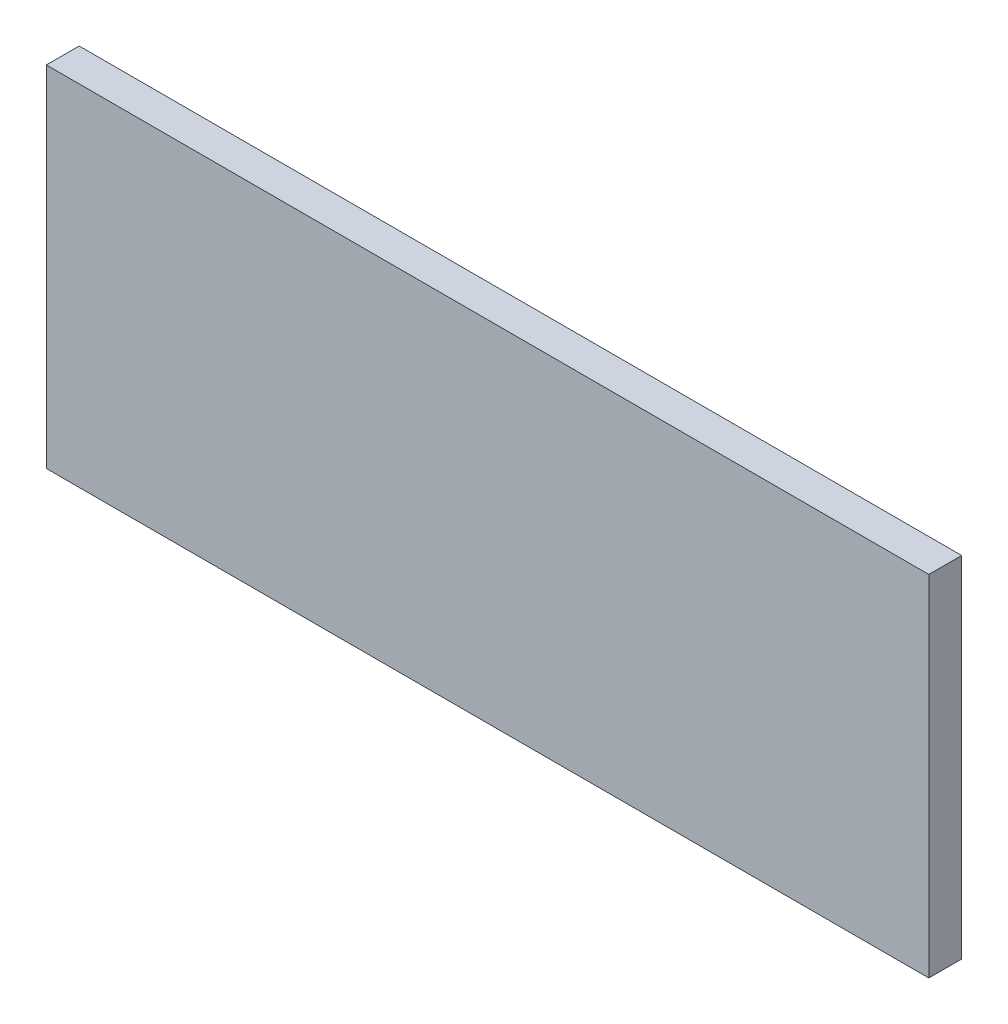
ISO-10303-21;
HEADER;
FILE_DESCRIPTION(('STEP AP214'),'2;1');
FILE_NAME('part.step','',(''),(''),'','','');
FILE_SCHEMA(('AUTOMOTIVE_DESIGN { 1 0 10303 214 1 1 1 1 }'));
ENDSEC;
DATA;
#1=APPLICATION_CONTEXT('core data for automotive mechanical design processes');
#2=APPLICATION_PROTOCOL_DEFINITION('international standard','automotive_design',2000,#1);
#3=PRODUCT_CONTEXT('',#1,'mechanical');
#4=PRODUCT('Part','Part','',(#3));
#5=PRODUCT_RELATED_PRODUCT_CATEGORY('part','',(#4));
#6=PRODUCT_DEFINITION_FORMATION('','',#4);
#7=PRODUCT_DEFINITION_CONTEXT('part definition',#1,'design');
#8=PRODUCT_DEFINITION('design','',#6,#7);
#9=PRODUCT_DEFINITION_SHAPE('','',#8);
#10=(LENGTH_UNIT() NAMED_UNIT(*) SI_UNIT(.MILLI.,.METRE.));
#11=(NAMED_UNIT(*) PLANE_ANGLE_UNIT() SI_UNIT($,.RADIAN.));
#12=(NAMED_UNIT(*) SI_UNIT($,.STERADIAN.) SOLID_ANGLE_UNIT());
#13=UNCERTAINTY_MEASURE_WITH_UNIT(LENGTH_MEASURE(1.E-05),#10,'distance_accuracy_value','');
#14=(GEOMETRIC_REPRESENTATION_CONTEXT(3) GLOBAL_UNCERTAINTY_ASSIGNED_CONTEXT((#13)) GLOBAL_UNIT_ASSIGNED_CONTEXT((#10,
#11,#12)) REPRESENTATION_CONTEXT('',''));
#15=CARTESIAN_POINT('',(0.,0.,0.));
#16=DIRECTION('',(0.,0.,1.));
#17=DIRECTION('',(1.,0.,0.));
#18=AXIS2_PLACEMENT_3D('',#15,#16,#17);
#19=CARTESIAN_POINT('',(38.9193321896784,48.3973428657123,15.9277503552776));
#20=DIRECTION('',(-1.,0.,0.));
#21=DIRECTION('',(0.,0.,1.));
#22=AXIS2_PLACEMENT_3D('',#19,#20,#21);
#23=PLANE('',#22);
#24=DIRECTION('',(0.,1.,0.));
#25=VECTOR('',#24,1.);
#26=CARTESIAN_POINT('',(38.9193321896784,48.3973428657123,14.9277503552776));
#27=LINE('',#26,#25);
#28=CARTESIAN_POINT('',(38.9193321896784,48.3973428657123,14.9277503552776));
#29=VERTEX_POINT('',#28);
#30=CARTESIAN_POINT('',(38.9193321896784,59.0392787902942,14.9277503552776));
#31=VERTEX_POINT('',#30);
#32=EDGE_CURVE('E97',#29,#31,#27,.T.);
#33=ORIENTED_EDGE('',*,*,#32,.T.);
#34=DIRECTION('',(0.,0.,-1.));
#35=VECTOR('',#34,1.);
#36=CARTESIAN_POINT('',(38.9193321896784,59.0392787902942,15.9277503552776));
#37=LINE('',#36,#35);
#38=CARTESIAN_POINT('',(38.9193321896784,59.0392787902942,15.9277503552776));
#39=VERTEX_POINT('',#38);
#40=EDGE_CURVE('E11',#39,#31,#37,.T.);
#41=ORIENTED_EDGE('',*,*,#40,.F.);
#42=DIRECTION('',(0.,1.,0.));
#43=VECTOR('',#42,1.);
#44=CARTESIAN_POINT('',(38.9193321896784,48.3973428657123,15.9277503552776));
#45=LINE('',#44,#43);
#46=CARTESIAN_POINT('',(38.9193321896784,48.3973428657123,15.9277503552776));
#47=VERTEX_POINT('',#46);
#48=EDGE_CURVE('E85',#47,#39,#45,.T.);
#49=ORIENTED_EDGE('',*,*,#48,.F.);
#50=DIRECTION('',(0.,0.,-1.));
#51=VECTOR('',#50,1.);
#52=CARTESIAN_POINT('',(38.9193321896784,48.3973428657123,15.9277503552776));
#53=LINE('',#52,#51);
#54=EDGE_CURVE('E93',#47,#29,#53,.T.);
#55=ORIENTED_EDGE('',*,*,#54,.T.);
#56=EDGE_LOOP('',(#33,#41,#49,#55));
#57=FACE_BOUND('',#56,.T.);
#58=ADVANCED_FACE('F34',(#57),#23,.F.);
#59=CARTESIAN_POINT('',(12.0487638720306,59.0392787902942,15.9277503552776));
#60=DIRECTION('',(0.,-1.,0.));
#61=DIRECTION('',(0.,0.,-1.));
#62=AXIS2_PLACEMENT_3D('',#59,#60,#61);
#63=PLANE('',#62);
#64=DIRECTION('',(-1.,0.,0.));
#65=VECTOR('',#64,1.);
#66=CARTESIAN_POINT('',(12.0487638720306,59.0392787902942,14.9277503552776));
#67=LINE('',#66,#65);
#68=CARTESIAN_POINT('',(12.0487638720306,59.0392787902942,14.9277503552776));
#69=VERTEX_POINT('',#68);
#70=EDGE_CURVE('E89',#31,#69,#67,.T.);
#71=ORIENTED_EDGE('',*,*,#70,.T.);
#72=DIRECTION('',(0.,0.,-1.));
#73=VECTOR('',#72,1.);
#74=CARTESIAN_POINT('',(12.0487638720306,59.0392787902942,15.9277503552776));
#75=LINE('',#74,#73);
#76=CARTESIAN_POINT('',(12.0487638720306,59.0392787902942,15.9277503552776));
#77=VERTEX_POINT('',#76);
#78=EDGE_CURVE('E42',#77,#69,#75,.T.);
#79=ORIENTED_EDGE('',*,*,#78,.F.);
#80=DIRECTION('',(-1.,0.,0.));
#81=VECTOR('',#80,1.);
#82=CARTESIAN_POINT('',(12.0487638720306,59.0392787902942,15.9277503552776));
#83=LINE('',#82,#81);
#84=EDGE_CURVE('E80',#39,#77,#83,.T.);
#85=ORIENTED_EDGE('',*,*,#84,.F.);
#86=ORIENTED_EDGE('',*,*,#40,.T.);
#87=EDGE_LOOP('',(#71,#79,#85,#86));
#88=FACE_BOUND('',#87,.T.);
#89=ADVANCED_FACE('F88',(#88),#63,.F.);
#90=CARTESIAN_POINT('',(12.0487638720306,48.3973428657123,15.9277503552776));
#91=DIRECTION('',(1.,0.,0.));
#92=DIRECTION('',(0.,0.,-1.));
#93=AXIS2_PLACEMENT_3D('',#90,#91,#92);
#94=PLANE('',#93);
#95=DIRECTION('',(0.,-1.,0.));
#96=VECTOR('',#95,1.);
#97=CARTESIAN_POINT('',(12.0487638720306,48.3973428657123,14.9277503552776));
#98=LINE('',#97,#96);
#99=CARTESIAN_POINT('',(12.0487638720306,48.3973428657123,14.9277503552776));
#100=VERTEX_POINT('',#99);
#101=EDGE_CURVE('E67',#69,#100,#98,.T.);
#102=ORIENTED_EDGE('',*,*,#101,.T.);
#103=DIRECTION('',(0.,0.,-1.));
#104=VECTOR('',#103,1.);
#105=CARTESIAN_POINT('',(12.0487638720306,48.3973428657123,15.9277503552776));
#106=LINE('',#105,#104);
#107=CARTESIAN_POINT('',(12.0487638720306,48.3973428657123,15.9277503552776));
#108=VERTEX_POINT('',#107);
#109=EDGE_CURVE('E90',#108,#100,#106,.T.);
#110=ORIENTED_EDGE('',*,*,#109,.F.);
#111=DIRECTION('',(0.,-1.,0.));
#112=VECTOR('',#111,1.);
#113=CARTESIAN_POINT('',(12.0487638720306,48.3973428657123,15.9277503552776));
#114=LINE('',#113,#112);
#115=EDGE_CURVE('E83',#77,#108,#114,.T.);
#116=ORIENTED_EDGE('',*,*,#115,.F.);
#117=ORIENTED_EDGE('',*,*,#78,.T.);
#118=EDGE_LOOP('',(#102,#110,#116,#117));
#119=FACE_BOUND('',#118,.T.);
#120=ADVANCED_FACE('F91',(#119),#94,.F.);
#121=CARTESIAN_POINT('',(12.0487638720306,48.3973428657123,15.9277503552776));
#122=DIRECTION('',(0.,1.,0.));
#123=DIRECTION('',(0.,0.,1.));
#124=AXIS2_PLACEMENT_3D('',#121,#122,#123);
#125=PLANE('',#124);
#126=DIRECTION('',(1.,0.,0.));
#127=VECTOR('',#126,1.);
#128=CARTESIAN_POINT('',(12.0487638720306,48.3973428657123,14.9277503552776));
#129=LINE('',#128,#127);
#130=EDGE_CURVE('E73',#100,#29,#129,.T.);
#131=ORIENTED_EDGE('',*,*,#130,.T.);
#132=ORIENTED_EDGE('',*,*,#54,.F.);
#133=DIRECTION('',(1.,0.,0.));
#134=VECTOR('',#133,1.);
#135=CARTESIAN_POINT('',(12.0487638720306,48.3973428657123,15.9277503552776));
#136=LINE('',#135,#134);
#137=EDGE_CURVE('E50',#108,#47,#136,.T.);
#138=ORIENTED_EDGE('',*,*,#137,.F.);
#139=ORIENTED_EDGE('',*,*,#109,.T.);
#140=EDGE_LOOP('',(#131,#132,#138,#139));
#141=FACE_BOUND('',#140,.T.);
#142=ADVANCED_FACE('F104',(#141),#125,.F.);
#143=CARTESIAN_POINT('',(0.,0.,15.9277503552776));
#144=DIRECTION('',(0.,0.,-1.));
#145=DIRECTION('',(-1.,0.,0.));
#146=AXIS2_PLACEMENT_3D('',#143,#144,#145);
#147=PLANE('',#146);
#148=ORIENTED_EDGE('',*,*,#48,.T.);
#149=ORIENTED_EDGE('',*,*,#84,.T.);
#150=ORIENTED_EDGE('',*,*,#115,.T.);
#151=ORIENTED_EDGE('',*,*,#137,.T.);
#152=EDGE_LOOP('',(#148,#149,#150,#151));
#153=FACE_BOUND('',#152,.T.);
#154=ADVANCED_FACE('F81',(#153),#147,.F.);
#155=CARTESIAN_POINT('',(0.,0.,14.9277503552776));
#156=DIRECTION('',(0.,0.,-1.));
#157=DIRECTION('',(-1.,0.,0.));
#158=AXIS2_PLACEMENT_3D('',#155,#156,#157);
#159=PLANE('',#158);
#160=ORIENTED_EDGE('',*,*,#32,.F.);
#161=ORIENTED_EDGE('',*,*,#130,.F.);
#162=ORIENTED_EDGE('',*,*,#101,.F.);
#163=ORIENTED_EDGE('',*,*,#70,.F.);
#164=EDGE_LOOP('',(#160,#161,#162,#163));
#165=FACE_BOUND('',#164,.T.);
#166=ADVANCED_FACE('F107',(#165),#159,.T.);
#167=CLOSED_SHELL('',(#58,#89,#120,#142,#154,#166));
#168=MANIFOLD_SOLID_BREP('B2',#167);
#169=ADVANCED_BREP_SHAPE_REPRESENTATION('',(#18,#168),#14);
#170=SHAPE_DEFINITION_REPRESENTATION(#9,#169);
ENDSEC;
END-ISO-10303-21;
